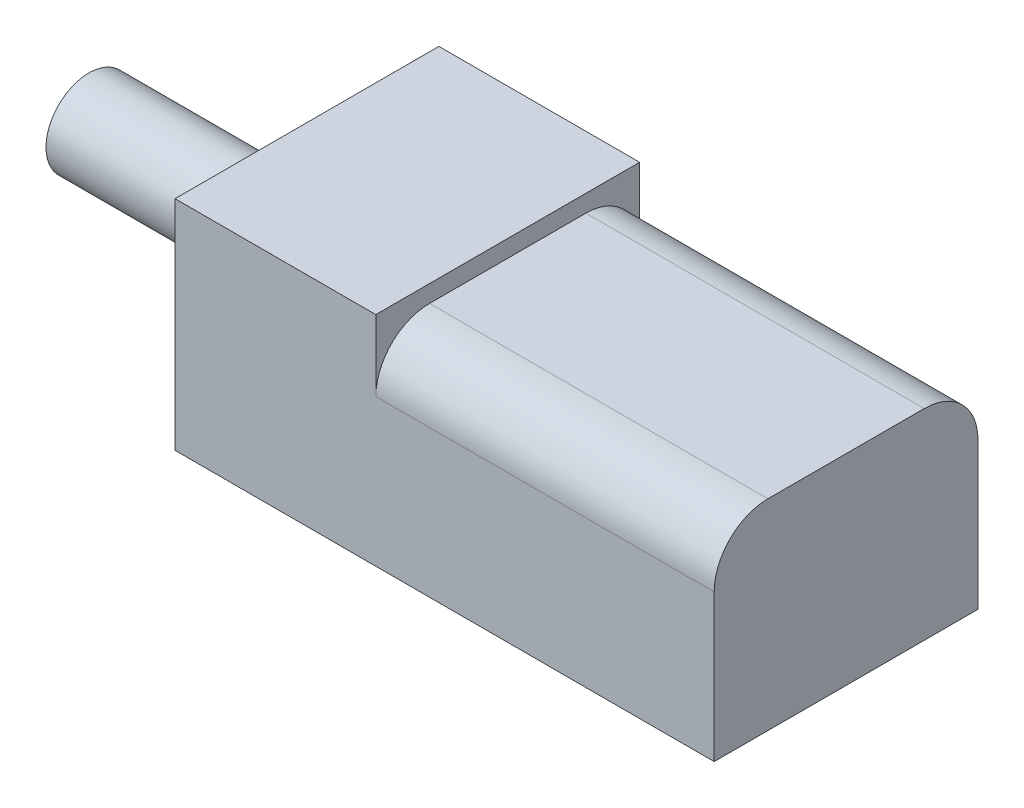
ISO-10303-21;
HEADER;
FILE_DESCRIPTION(('STEP AP214'),'2;1');
FILE_NAME('part.step','',(''),(''),'','','');
FILE_SCHEMA(('AUTOMOTIVE_DESIGN { 1 0 10303 214 1 1 1 1 }'));
ENDSEC;
DATA;
#1=APPLICATION_CONTEXT('core data for automotive mechanical design processes');
#2=APPLICATION_PROTOCOL_DEFINITION('international standard','automotive_design',2000,#1);
#3=PRODUCT_CONTEXT('',#1,'mechanical');
#4=PRODUCT('Part','Part','',(#3));
#5=PRODUCT_RELATED_PRODUCT_CATEGORY('part','',(#4));
#6=PRODUCT_DEFINITION_FORMATION('','',#4);
#7=PRODUCT_DEFINITION_CONTEXT('part definition',#1,'design');
#8=PRODUCT_DEFINITION('design','',#6,#7);
#9=PRODUCT_DEFINITION_SHAPE('','',#8);
#10=(LENGTH_UNIT() NAMED_UNIT(*) SI_UNIT(.MILLI.,.METRE.));
#11=(NAMED_UNIT(*) PLANE_ANGLE_UNIT() SI_UNIT($,.RADIAN.));
#12=(NAMED_UNIT(*) SI_UNIT($,.STERADIAN.) SOLID_ANGLE_UNIT());
#13=UNCERTAINTY_MEASURE_WITH_UNIT(LENGTH_MEASURE(1.E-05),#10,'distance_accuracy_value','');
#14=(GEOMETRIC_REPRESENTATION_CONTEXT(3) GLOBAL_UNCERTAINTY_ASSIGNED_CONTEXT((#13)) GLOBAL_UNIT_ASSIGNED_CONTEXT((#10,
#11,#12)) REPRESENTATION_CONTEXT('',''));
#15=CARTESIAN_POINT('',(0.,0.,0.));
#16=DIRECTION('',(0.,0.,1.));
#17=DIRECTION('',(1.,0.,0.));
#18=AXIS2_PLACEMENT_3D('',#15,#16,#17);
#19=CARTESIAN_POINT('',(0.,8.89,0.));
#20=DIRECTION('',(0.,0.,-1.));
#21=DIRECTION('',(-1.,0.,0.));
#22=AXIS2_PLACEMENT_3D('',#19,#20,#21);
#23=PLANE('',#22);
#24=DIRECTION('',(0.,-1.,0.));
#25=VECTOR('',#24,1.);
#26=CARTESIAN_POINT('',(14.986,8.89,0.));
#27=LINE('',#26,#25);
#28=CARTESIAN_POINT('',(14.986,6.51,0.));
#29=VERTEX_POINT('',#28);
#30=CARTESIAN_POINT('',(14.986,0.,0.));
#31=VERTEX_POINT('',#30);
#32=EDGE_CURVE('E155',#29,#31,#27,.T.);
#33=ORIENTED_EDGE('',*,*,#32,.F.);
#34=DIRECTION('',(1.,0.,0.));
#35=VECTOR('',#34,1.);
#36=CARTESIAN_POINT('',(0.,6.51,0.));
#37=LINE('',#36,#35);
#38=CARTESIAN_POINT('',(0.,6.51,0.));
#39=VERTEX_POINT('',#38);
#40=EDGE_CURVE('E109',#29,#39,#37,.F.);
#41=ORIENTED_EDGE('',*,*,#40,.T.);
#42=DIRECTION('',(0.,-1.,0.));
#43=VECTOR('',#42,1.);
#44=CARTESIAN_POINT('',(0.,9.652,0.));
#45=LINE('',#44,#43);
#46=CARTESIAN_POINT('',(0.,9.652,0.));
#47=VERTEX_POINT('',#46);
#48=EDGE_CURVE('E53',#47,#39,#45,.T.);
#49=ORIENTED_EDGE('',*,*,#48,.F.);
#50=DIRECTION('',(-1.,0.,0.));
#51=VECTOR('',#50,1.);
#52=CARTESIAN_POINT('',(0.,9.652,0.));
#53=LINE('',#52,#51);
#54=CARTESIAN_POINT('',(-8.89,9.652,0.));
#55=VERTEX_POINT('',#54);
#56=EDGE_CURVE('E107',#47,#55,#53,.T.);
#57=ORIENTED_EDGE('',*,*,#56,.T.);
#58=DIRECTION('',(0.,-1.,0.));
#59=VECTOR('',#58,1.);
#60=CARTESIAN_POINT('',(-8.89,9.652,0.));
#61=LINE('',#60,#59);
#62=CARTESIAN_POINT('',(-8.89,0.,0.));
#63=VERTEX_POINT('',#62);
#64=EDGE_CURVE('E111',#55,#63,#61,.T.);
#65=ORIENTED_EDGE('',*,*,#64,.T.);
#66=DIRECTION('',(1.,0.,0.));
#67=VECTOR('',#66,1.);
#68=CARTESIAN_POINT('',(0.,0.,0.));
#69=LINE('',#68,#67);
#70=EDGE_CURVE('E145',#63,#31,#69,.T.);
#71=ORIENTED_EDGE('',*,*,#70,.T.);
#72=EDGE_LOOP('',(#33,#41,#49,#57,#65,#71));
#73=FACE_BOUND('',#72,.T.);
#74=ADVANCED_FACE('F37',(#73),#23,.F.);
#75=CARTESIAN_POINT('',(14.986,8.89,0.));
#76=DIRECTION('',(-1.,0.,0.));
#77=DIRECTION('',(0.,0.,1.));
#78=AXIS2_PLACEMENT_3D('',#75,#76,#77);
#79=PLANE('',#78);
#80=DIRECTION('',(0.,-1.,0.));
#81=VECTOR('',#80,1.);
#82=CARTESIAN_POINT('',(14.986,8.89,-11.684));
#83=LINE('',#82,#81);
#84=CARTESIAN_POINT('',(14.986,6.51,-11.684));
#85=VERTEX_POINT('',#84);
#86=CARTESIAN_POINT('',(14.986,0.,-11.684));
#87=VERTEX_POINT('',#86);
#88=EDGE_CURVE('E147',#85,#87,#83,.T.);
#89=ORIENTED_EDGE('',*,*,#88,.F.);
#90=CARTESIAN_POINT('',(14.986,6.51,-9.304));
#91=DIRECTION('',(-1.,0.,0.));
#92=DIRECTION('',(0.,0.,1.));
#93=AXIS2_PLACEMENT_3D('',#90,#91,#92);
#94=CIRCLE('',#93,2.38);
#95=CARTESIAN_POINT('',(14.986,8.89,-9.304));
#96=VERTEX_POINT('',#95);
#97=EDGE_CURVE('E163',#85,#96,#94,.F.);
#98=ORIENTED_EDGE('',*,*,#97,.T.);
#99=DIRECTION('',(0.,0.,-1.));
#100=VECTOR('',#99,1.);
#101=CARTESIAN_POINT('',(14.986,8.89,0.));
#102=LINE('',#101,#100);
#103=CARTESIAN_POINT('',(14.986,8.89,-2.38));
#104=VERTEX_POINT('',#103);
#105=EDGE_CURVE('E144',#104,#96,#102,.T.);
#106=ORIENTED_EDGE('',*,*,#105,.F.);
#107=CARTESIAN_POINT('',(14.986,6.51,-2.38));
#108=DIRECTION('',(-1.,0.,0.));
#109=DIRECTION('',(0.,0.,1.));
#110=AXIS2_PLACEMENT_3D('',#107,#108,#109);
#111=CIRCLE('',#110,2.38);
#112=EDGE_CURVE('E161',#104,#29,#111,.F.);
#113=ORIENTED_EDGE('',*,*,#112,.T.);
#114=ORIENTED_EDGE('',*,*,#32,.T.);
#115=DIRECTION('',(0.,0.,-1.));
#116=VECTOR('',#115,1.);
#117=CARTESIAN_POINT('',(14.986,0.,0.));
#118=LINE('',#117,#116);
#119=EDGE_CURVE('E150',#31,#87,#118,.T.);
#120=ORIENTED_EDGE('',*,*,#119,.T.);
#121=EDGE_LOOP('',(#89,#98,#106,#113,#114,#120));
#122=FACE_BOUND('',#121,.T.);
#123=ADVANCED_FACE('F178',(#122),#79,.F.);
#124=CARTESIAN_POINT('',(0.,8.89,-11.684));
#125=DIRECTION('',(0.,0.,-1.));
#126=DIRECTION('',(-1.,0.,0.));
#127=AXIS2_PLACEMENT_3D('',#124,#125,#126);
#128=PLANE('',#127);
#129=DIRECTION('',(0.,-1.,0.));
#130=VECTOR('',#129,1.);
#131=CARTESIAN_POINT('',(0.,9.652,-11.684));
#132=LINE('',#131,#130);
#133=CARTESIAN_POINT('',(0.,9.652,-11.684));
#134=VERTEX_POINT('',#133);
#135=CARTESIAN_POINT('',(0.,6.51,-11.684));
#136=VERTEX_POINT('',#135);
#137=EDGE_CURVE('E126',#134,#136,#132,.T.);
#138=ORIENTED_EDGE('',*,*,#137,.T.);
#139=DIRECTION('',(1.,0.,0.));
#140=VECTOR('',#139,1.);
#141=CARTESIAN_POINT('',(14.986,6.51,-11.684));
#142=LINE('',#141,#140);
#143=EDGE_CURVE('E157',#136,#85,#142,.T.);
#144=ORIENTED_EDGE('',*,*,#143,.T.);
#145=ORIENTED_EDGE('',*,*,#88,.T.);
#146=DIRECTION('',(1.,0.,0.));
#147=VECTOR('',#146,1.);
#148=CARTESIAN_POINT('',(0.,0.,-11.684));
#149=LINE('',#148,#147);
#150=CARTESIAN_POINT('',(-8.89,0.,-11.684));
#151=VERTEX_POINT('',#150);
#152=EDGE_CURVE('E137',#151,#87,#149,.T.);
#153=ORIENTED_EDGE('',*,*,#152,.F.);
#154=DIRECTION('',(0.,-1.,0.));
#155=VECTOR('',#154,1.);
#156=CARTESIAN_POINT('',(-8.89,9.652,-11.684));
#157=LINE('',#156,#155);
#158=CARTESIAN_POINT('',(-8.89,9.652,-11.684));
#159=VERTEX_POINT('',#158);
#160=EDGE_CURVE('E138',#159,#151,#157,.T.);
#161=ORIENTED_EDGE('',*,*,#160,.F.);
#162=DIRECTION('',(1.,0.,0.));
#163=VECTOR('',#162,1.);
#164=CARTESIAN_POINT('',(0.,9.652,-11.684));
#165=LINE('',#164,#163);
#166=EDGE_CURVE('E112',#159,#134,#165,.T.);
#167=ORIENTED_EDGE('',*,*,#166,.T.);
#168=EDGE_LOOP('',(#138,#144,#145,#153,#161,#167));
#169=FACE_BOUND('',#168,.T.);
#170=ADVANCED_FACE('F184',(#169),#128,.T.);
#171=CARTESIAN_POINT('',(0.,8.89,0.));
#172=DIRECTION('',(0.,-1.,0.));
#173=DIRECTION('',(0.,0.,-1.));
#174=AXIS2_PLACEMENT_3D('',#171,#172,#173);
#175=PLANE('',#174);
#176=ORIENTED_EDGE('',*,*,#105,.T.);
#177=DIRECTION('',(1.,0.,0.));
#178=VECTOR('',#177,1.);
#179=CARTESIAN_POINT('',(0.,8.89,-9.304));
#180=LINE('',#179,#178);
#181=CARTESIAN_POINT('',(0.,8.89,-9.304));
#182=VERTEX_POINT('',#181);
#183=EDGE_CURVE('E61',#96,#182,#180,.F.);
#184=ORIENTED_EDGE('',*,*,#183,.T.);
#185=DIRECTION('',(0.,0.,-1.));
#186=VECTOR('',#185,1.);
#187=CARTESIAN_POINT('',(0.,8.89,0.));
#188=LINE('',#187,#186);
#189=CARTESIAN_POINT('',(0.,8.89,-2.38));
#190=VERTEX_POINT('',#189);
#191=EDGE_CURVE('E142',#190,#182,#188,.T.);
#192=ORIENTED_EDGE('',*,*,#191,.F.);
#193=DIRECTION('',(1.,0.,0.));
#194=VECTOR('',#193,1.);
#195=CARTESIAN_POINT('',(0.,8.89,-2.38));
#196=LINE('',#195,#194);
#197=EDGE_CURVE('E165',#190,#104,#196,.T.);
#198=ORIENTED_EDGE('',*,*,#197,.T.);
#199=EDGE_LOOP('',(#176,#184,#192,#198));
#200=FACE_BOUND('',#199,.T.);
#201=ADVANCED_FACE('F174',(#200),#175,.F.);
#202=CARTESIAN_POINT('',(0.,0.,0.));
#203=DIRECTION('',(0.,-1.,0.));
#204=DIRECTION('',(0.,0.,-1.));
#205=AXIS2_PLACEMENT_3D('',#202,#203,#204);
#206=PLANE('',#205);
#207=ORIENTED_EDGE('',*,*,#70,.F.);
#208=DIRECTION('',(0.,0.,-1.));
#209=VECTOR('',#208,1.);
#210=CARTESIAN_POINT('',(-8.89,0.,0.));
#211=LINE('',#210,#209);
#212=EDGE_CURVE('E127',#63,#151,#211,.T.);
#213=ORIENTED_EDGE('',*,*,#212,.T.);
#214=ORIENTED_EDGE('',*,*,#152,.T.);
#215=ORIENTED_EDGE('',*,*,#119,.F.);
#216=EDGE_LOOP('',(#207,#213,#214,#215));
#217=FACE_BOUND('',#216,.T.);
#218=ADVANCED_FACE('F182',(#217),#206,.T.);
#219=CARTESIAN_POINT('',(0.,9.652,0.));
#220=DIRECTION('',(1.,0.,0.));
#221=DIRECTION('',(0.,0.,-1.));
#222=AXIS2_PLACEMENT_3D('',#219,#220,#221);
#223=PLANE('',#222);
#224=ORIENTED_EDGE('',*,*,#48,.T.);
#225=CARTESIAN_POINT('',(0.,6.51,-2.38));
#226=DIRECTION('',(1.,0.,0.));
#227=DIRECTION('',(0.,0.,-1.));
#228=AXIS2_PLACEMENT_3D('',#225,#226,#227);
#229=CIRCLE('',#228,2.38);
#230=EDGE_CURVE('E41',#39,#190,#229,.F.);
#231=ORIENTED_EDGE('',*,*,#230,.T.);
#232=ORIENTED_EDGE('',*,*,#191,.T.);
#233=CARTESIAN_POINT('',(0.,6.51,-9.304));
#234=DIRECTION('',(1.,0.,0.));
#235=DIRECTION('',(0.,0.,-1.));
#236=AXIS2_PLACEMENT_3D('',#233,#234,#235);
#237=CIRCLE('',#236,2.38);
#238=EDGE_CURVE('E169',#182,#136,#237,.F.);
#239=ORIENTED_EDGE('',*,*,#238,.T.);
#240=ORIENTED_EDGE('',*,*,#137,.F.);
#241=DIRECTION('',(0.,0.,1.));
#242=VECTOR('',#241,1.);
#243=CARTESIAN_POINT('',(0.,9.652,0.));
#244=LINE('',#243,#242);
#245=EDGE_CURVE('E119',#134,#47,#244,.T.);
#246=ORIENTED_EDGE('',*,*,#245,.T.);
#247=EDGE_LOOP('',(#224,#231,#232,#239,#240,#246));
#248=FACE_BOUND('',#247,.T.);
#249=ADVANCED_FACE('F124',(#248),#223,.T.);
#250=CARTESIAN_POINT('',(-8.89,9.652,0.));
#251=DIRECTION('',(-1.,0.,0.));
#252=DIRECTION('',(0.,0.,1.));
#253=AXIS2_PLACEMENT_3D('',#250,#251,#252);
#254=PLANE('',#253);
#255=CARTESIAN_POINT('',(-8.89,4.826,-1.397));
#256=DIRECTION('',(-1.,0.,0.));
#257=DIRECTION('',(0.,0.,1.));
#258=AXIS2_PLACEMENT_3D('',#255,#256,#257);
#259=CIRCLE('',#258,0.889);
#260=CARTESIAN_POINT('',(-8.89,4.826,-0.508000000000001));
#261=VERTEX_POINT('',#260);
#262=EDGE_CURVE('E244',#261,#261,#259,.T.);
#263=ORIENTED_EDGE('',*,*,#262,.F.);
#264=EDGE_LOOP('',(#263));
#265=FACE_BOUND('',#264,.T.);
#266=CARTESIAN_POINT('',(-8.89,4.826,-10.287));
#267=DIRECTION('',(-1.,0.,0.));
#268=DIRECTION('',(0.,0.,-1.));
#269=AXIS2_PLACEMENT_3D('',#266,#267,#268);
#270=CIRCLE('',#269,0.889);
#271=CARTESIAN_POINT('',(-8.89,4.826,-11.176));
#272=VERTEX_POINT('',#271);
#273=EDGE_CURVE('E253',#272,#272,#270,.T.);
#274=ORIENTED_EDGE('',*,*,#273,.F.);
#275=EDGE_LOOP('',(#274));
#276=FACE_BOUND('',#275,.T.);
#277=CARTESIAN_POINT('',(-8.89,4.826,-5.842));
#278=DIRECTION('',(-1.,0.,0.));
#279=DIRECTION('',(0.,0.,1.));
#280=AXIS2_PLACEMENT_3D('',#277,#278,#279);
#281=CIRCLE('',#280,1.905);
#282=CARTESIAN_POINT('',(-8.89,4.826,-3.937));
#283=VERTEX_POINT('',#282);
#284=EDGE_CURVE('E11',#283,#283,#281,.T.);
#285=ORIENTED_EDGE('',*,*,#284,.F.);
#286=EDGE_LOOP('',(#285));
#287=FACE_BOUND('',#286,.T.);
#288=ORIENTED_EDGE('',*,*,#212,.F.);
#289=ORIENTED_EDGE('',*,*,#64,.F.);
#290=DIRECTION('',(0.,0.,-1.));
#291=VECTOR('',#290,1.);
#292=CARTESIAN_POINT('',(-8.89,9.652,0.));
#293=LINE('',#292,#291);
#294=EDGE_CURVE('E122',#55,#159,#293,.T.);
#295=ORIENTED_EDGE('',*,*,#294,.T.);
#296=ORIENTED_EDGE('',*,*,#160,.T.);
#297=EDGE_LOOP('',(#288,#289,#295,#296));
#298=FACE_BOUND('',#297,.T.);
#299=ADVANCED_FACE('F193',(#265,#276,#287,#298),#254,.T.);
#300=CARTESIAN_POINT('',(0.,9.652,0.));
#301=DIRECTION('',(0.,1.,0.));
#302=DIRECTION('',(0.,0.,1.));
#303=AXIS2_PLACEMENT_3D('',#300,#301,#302);
#304=PLANE('',#303);
#305=ORIENTED_EDGE('',*,*,#245,.F.);
#306=ORIENTED_EDGE('',*,*,#166,.F.);
#307=ORIENTED_EDGE('',*,*,#294,.F.);
#308=ORIENTED_EDGE('',*,*,#56,.F.);
#309=EDGE_LOOP('',(#305,#306,#307,#308));
#310=FACE_BOUND('',#309,.T.);
#311=ADVANCED_FACE('F117',(#310),#304,.T.);
#312=CARTESIAN_POINT('',(0.,6.51,-9.304));
#313=DIRECTION('',(-1.,0.,0.));
#314=DIRECTION('',(0.,0.,1.));
#315=AXIS2_PLACEMENT_3D('',#312,#313,#314);
#316=CYLINDRICAL_SURFACE('',#315,2.38);
#317=ORIENTED_EDGE('',*,*,#238,.F.);
#318=ORIENTED_EDGE('',*,*,#183,.F.);
#319=ORIENTED_EDGE('',*,*,#97,.F.);
#320=ORIENTED_EDGE('',*,*,#143,.F.);
#321=EDGE_LOOP('',(#317,#318,#319,#320));
#322=FACE_BOUND('',#321,.T.);
#323=ADVANCED_FACE('F186',(#322),#316,.T.);
#324=CARTESIAN_POINT('',(0.,6.51,-2.38));
#325=DIRECTION('',(1.,0.,0.));
#326=DIRECTION('',(0.,0.,-1.));
#327=AXIS2_PLACEMENT_3D('',#324,#325,#326);
#328=CYLINDRICAL_SURFACE('',#327,2.38);
#329=ORIENTED_EDGE('',*,*,#230,.F.);
#330=ORIENTED_EDGE('',*,*,#40,.F.);
#331=ORIENTED_EDGE('',*,*,#112,.F.);
#332=ORIENTED_EDGE('',*,*,#197,.F.);
#333=EDGE_LOOP('',(#329,#330,#331,#332));
#334=FACE_BOUND('',#333,.T.);
#335=ADVANCED_FACE('F39',(#334),#328,.T.);
#336=CARTESIAN_POINT('',(-18.542,4.826,-5.842));
#337=DIRECTION('',(1.,0.,0.));
#338=DIRECTION('',(0.,0.,-1.));
#339=AXIS2_PLACEMENT_3D('',#336,#337,#338);
#340=CYLINDRICAL_SURFACE('',#339,1.905);
#341=CARTESIAN_POINT('',(-18.542,4.826,-5.842));
#342=DIRECTION('',(-1.,0.,0.));
#343=DIRECTION('',(0.,0.,1.));
#344=AXIS2_PLACEMENT_3D('',#341,#342,#343);
#345=CIRCLE('',#344,1.905);
#346=CARTESIAN_POINT('',(-18.542,4.826,-3.937));
#347=VERTEX_POINT('',#346);
#348=EDGE_CURVE('E130',#347,#347,#345,.T.);
#349=ORIENTED_EDGE('',*,*,#348,.F.);
#350=EDGE_LOOP('',(#349));
#351=FACE_BOUND('',#350,.T.);
#352=ORIENTED_EDGE('',*,*,#284,.T.);
#353=EDGE_LOOP('',(#352));
#354=FACE_BOUND('',#353,.T.);
#355=ADVANCED_FACE('F192',(#351,#354),#340,.T.);
#356=CARTESIAN_POINT('',(-18.542,4.826,-5.842));
#357=DIRECTION('',(-1.,0.,0.));
#358=DIRECTION('',(0.,0.,1.));
#359=AXIS2_PLACEMENT_3D('',#356,#357,#358);
#360=PLANE('',#359);
#361=ORIENTED_EDGE('',*,*,#348,.T.);
#362=EDGE_LOOP('',(#361));
#363=FACE_BOUND('',#362,.T.);
#364=ADVANCED_FACE('F219',(#363),#360,.T.);
#365=CARTESIAN_POINT('',(-1.778,4.826,-10.287));
#366=DIRECTION('',(-1.,0.,0.));
#367=DIRECTION('',(0.,0.,1.));
#368=AXIS2_PLACEMENT_3D('',#365,#366,#367);
#369=CYLINDRICAL_SURFACE('',#368,0.889);
#370=CARTESIAN_POINT('',(-1.778,4.826,-10.287));
#371=DIRECTION('',(-1.,0.,0.));
#372=DIRECTION('',(0.,0.,-1.));
#373=AXIS2_PLACEMENT_3D('',#370,#371,#372);
#374=CIRCLE('',#373,0.889);
#375=CARTESIAN_POINT('',(-1.778,4.826,-11.176));
#376=VERTEX_POINT('',#375);
#377=EDGE_CURVE('E248',#376,#376,#374,.T.);
#378=ORIENTED_EDGE('',*,*,#377,.F.);
#379=EDGE_LOOP('',(#378));
#380=FACE_BOUND('',#379,.T.);
#381=ORIENTED_EDGE('',*,*,#273,.T.);
#382=EDGE_LOOP('',(#381));
#383=FACE_BOUND('',#382,.T.);
#384=ADVANCED_FACE('F223',(#380,#383),#369,.F.);
#385=CARTESIAN_POINT('',(-1.778,4.826,-10.287));
#386=DIRECTION('',(1.,0.,0.));
#387=DIRECTION('',(0.,0.,-1.));
#388=AXIS2_PLACEMENT_3D('',#385,#386,#387);
#389=PLANE('',#388);
#390=ORIENTED_EDGE('',*,*,#377,.T.);
#391=EDGE_LOOP('',(#390));
#392=FACE_BOUND('',#391,.T.);
#393=ADVANCED_FACE('F227',(#392),#389,.F.);
#394=CARTESIAN_POINT('',(-1.778,4.826,-1.397));
#395=DIRECTION('',(-1.,0.,0.));
#396=DIRECTION('',(0.,0.,1.));
#397=AXIS2_PLACEMENT_3D('',#394,#395,#396);
#398=CYLINDRICAL_SURFACE('',#397,0.889);
#399=CARTESIAN_POINT('',(-1.778,4.826,-1.397));
#400=DIRECTION('',(-1.,0.,0.));
#401=DIRECTION('',(0.,0.,1.));
#402=AXIS2_PLACEMENT_3D('',#399,#400,#401);
#403=CIRCLE('',#402,0.889);
#404=CARTESIAN_POINT('',(-1.778,4.826,-0.508));
#405=VERTEX_POINT('',#404);
#406=EDGE_CURVE('E243',#405,#405,#403,.T.);
#407=ORIENTED_EDGE('',*,*,#406,.F.);
#408=EDGE_LOOP('',(#407));
#409=FACE_BOUND('',#408,.T.);
#410=ORIENTED_EDGE('',*,*,#262,.T.);
#411=EDGE_LOOP('',(#410));
#412=FACE_BOUND('',#411,.T.);
#413=ADVANCED_FACE('F231',(#409,#412),#398,.F.);
#414=CARTESIAN_POINT('',(-1.778,4.826,-1.397));
#415=DIRECTION('',(-1.,0.,0.));
#416=DIRECTION('',(0.,0.,1.));
#417=AXIS2_PLACEMENT_3D('',#414,#415,#416);
#418=PLANE('',#417);
#419=ORIENTED_EDGE('',*,*,#406,.T.);
#420=EDGE_LOOP('',(#419));
#421=FACE_BOUND('',#420,.T.);
#422=ADVANCED_FACE('F235',(#421),#418,.T.);
#423=CLOSED_SHELL('',(#74,#123,#170,#201,#218,#249,#299,#311,#323,#335,#355,#364,#384,#393,#413,#422));
#424=MANIFOLD_SOLID_BREP('B2',#423);
#425=ADVANCED_BREP_SHAPE_REPRESENTATION('',(#18,#424),#14);
#426=SHAPE_DEFINITION_REPRESENTATION(#9,#425);
ENDSEC;
END-ISO-10303-21;
